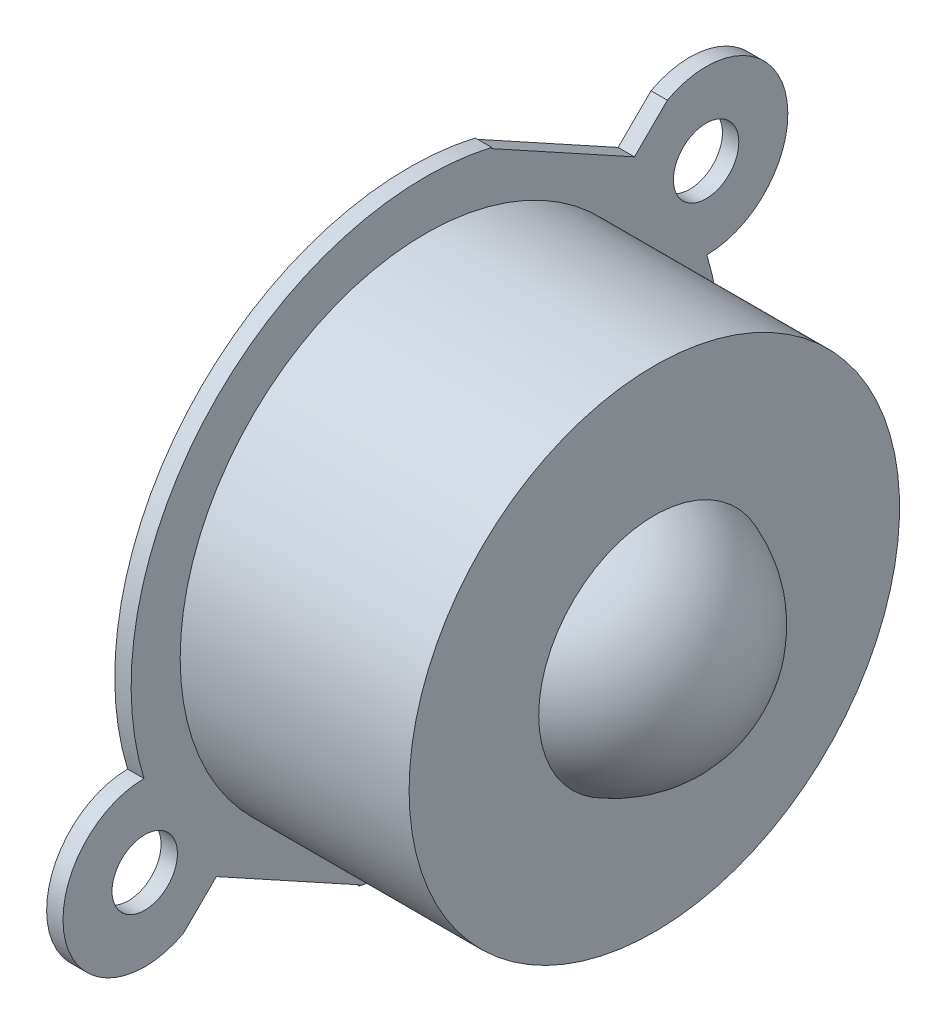
ISO-10303-21;
HEADER;
FILE_DESCRIPTION(('STEP AP214'),'2;1');
FILE_NAME('part.step','',(''),(''),'','','');
FILE_SCHEMA(('AUTOMOTIVE_DESIGN { 1 0 10303 214 1 1 1 1 }'));
ENDSEC;
DATA;
#1=APPLICATION_CONTEXT('core data for automotive mechanical design processes');
#2=APPLICATION_PROTOCOL_DEFINITION('international standard','automotive_design',2000,#1);
#3=PRODUCT_CONTEXT('',#1,'mechanical');
#4=PRODUCT('Part','Part','',(#3));
#5=PRODUCT_RELATED_PRODUCT_CATEGORY('part','',(#4));
#6=PRODUCT_DEFINITION_FORMATION('','',#4);
#7=PRODUCT_DEFINITION_CONTEXT('part definition',#1,'design');
#8=PRODUCT_DEFINITION('design','',#6,#7);
#9=PRODUCT_DEFINITION_SHAPE('','',#8);
#10=(LENGTH_UNIT() NAMED_UNIT(*) SI_UNIT(.MILLI.,.METRE.));
#11=(NAMED_UNIT(*) PLANE_ANGLE_UNIT() SI_UNIT($,.RADIAN.));
#12=(NAMED_UNIT(*) SI_UNIT($,.STERADIAN.) SOLID_ANGLE_UNIT());
#13=UNCERTAINTY_MEASURE_WITH_UNIT(LENGTH_MEASURE(1.E-05),#10,'distance_accuracy_value','');
#14=(GEOMETRIC_REPRESENTATION_CONTEXT(3) GLOBAL_UNCERTAINTY_ASSIGNED_CONTEXT((#13)) GLOBAL_UNIT_ASSIGNED_CONTEXT((#10,
#11,#12)) REPRESENTATION_CONTEXT('',''));
#15=CARTESIAN_POINT('',(0.,0.,0.));
#16=DIRECTION('',(0.,0.,1.));
#17=DIRECTION('',(1.,0.,0.));
#18=AXIS2_PLACEMENT_3D('',#15,#16,#17);
#19=CARTESIAN_POINT('',(0.,-15.,0.));
#20=DIRECTION('',(1.,0.,0.));
#21=DIRECTION('',(0.,0.,-1.));
#22=AXIS2_PLACEMENT_3D('',#19,#20,#21);
#23=PLANE('',#22);
#24=CARTESIAN_POINT('',(0.,-10.2598604714305,17.1678555185782));
#25=DIRECTION('',(1.,0.,0.));
#26=DIRECTION('',(0.,0.,1.));
#27=AXIS2_PLACEMENT_3D('',#24,#25,#26);
#28=CIRCLE('',#27,2.);
#29=CARTESIAN_POINT('',(0.,-10.2598604714305,19.1678555185782));
#30=VERTEX_POINT('',#29);
#31=EDGE_CURVE('E208',#30,#30,#28,.T.);
#32=ORIENTED_EDGE('',*,*,#31,.F.);
#33=EDGE_LOOP('',(#32));
#34=FACE_BOUND('',#33,.T.);
#35=CARTESIAN_POINT('',(0.,10.2598604714305,-17.1678555185782));
#36=DIRECTION('',(1.,0.,0.));
#37=DIRECTION('',(0.,0.,-1.));
#38=AXIS2_PLACEMENT_3D('',#35,#36,#37);
#39=CIRCLE('',#38,2.);
#40=CARTESIAN_POINT('',(0.,10.2598604714305,-19.1678555185782));
#41=VERTEX_POINT('',#40);
#42=EDGE_CURVE('E212',#41,#41,#39,.T.);
#43=ORIENTED_EDGE('',*,*,#42,.F.);
#44=EDGE_LOOP('',(#43));
#45=FACE_BOUND('',#44,.T.);
#46=CARTESIAN_POINT('',(0.,0.,0.));
#47=DIRECTION('',(-1.,0.,0.));
#48=DIRECTION('',(0.,0.,1.));
#49=AXIS2_PLACEMENT_3D('',#46,#47,#48);
#50=CIRCLE('',#49,15.);
#51=CARTESIAN_POINT('',(0.,0.,15.));
#52=VERTEX_POINT('',#51);
#53=EDGE_CURVE('E216',#52,#52,#50,.T.);
#54=ORIENTED_EDGE('',*,*,#53,.T.);
#55=EDGE_LOOP('',(#54));
#56=FACE_BOUND('',#55,.T.);
#57=CARTESIAN_POINT('',(0.,10.2598604714305,-17.1678555185782));
#58=DIRECTION('',(1.,0.,0.));
#59=DIRECTION('',(0.,0.,-1.));
#60=AXIS2_PLACEMENT_3D('',#57,#58,#59);
#61=CIRCLE('',#60,5.);
#62=CARTESIAN_POINT('',(0.,5.26007604358219,-17.2142847663135));
#63=VERTEX_POINT('',#62);
#64=CARTESIAN_POINT('',(0.,14.6632293174105,-14.7992392967616));
#65=VERTEX_POINT('',#64);
#66=EDGE_CURVE('E193',#63,#65,#61,.T.);
#67=ORIENTED_EDGE('',*,*,#66,.T.);
#68=DIRECTION('',(0.,-0.703835007235703,0.710363486244555));
#69=VECTOR('',#68,1.);
#70=CARTESIAN_POINT('',(0.,19.7073802025997,-19.8901776148475));
#71=LINE('',#70,#69);
#72=CARTESIAN_POINT('',(0.,12.6690301302427,-12.786542752402));
#73=VERTEX_POINT('',#72);
#74=EDGE_CURVE('E159',#65,#73,#71,.T.);
#75=ORIENTED_EDGE('',*,*,#74,.T.);
#76=DIRECTION('',(0.,0.481833931762426,0.876262553235252));
#77=VECTOR('',#76,1.);
#78=CARTESIAN_POINT('',(0.,12.6690301302427,-12.786542752402));
#79=LINE('',#78,#77);
#80=CARTESIAN_POINT('',(0.,17.4873694478669,-4.02391722004947));
#81=VERTEX_POINT('',#80);
#82=EDGE_CURVE('E190',#73,#81,#79,.T.);
#83=ORIENTED_EDGE('',*,*,#82,.T.);
#84=CARTESIAN_POINT('',(0.,10.2598604714305,-17.1678555185782));
#85=DIRECTION('',(1.,0.,0.));
#86=DIRECTION('',(0.,0.,-1.));
#87=AXIS2_PLACEMENT_3D('',#84,#85,#86);
#88=CIRCLE('',#87,15.);
#89=CARTESIAN_POINT('',(0.,17.5380198286192,-4.05189591314462));
#90=VERTEX_POINT('',#89);
#91=EDGE_CURVE('E187',#90,#81,#88,.T.);
#92=ORIENTED_EDGE('',*,*,#91,.F.);
#93=CARTESIAN_POINT('',(0.,0.,0.));
#94=DIRECTION('',(1.,0.,0.));
#95=DIRECTION('',(0.,0.,1.));
#96=AXIS2_PLACEMENT_3D('',#93,#94,#95);
#97=CIRCLE('',#96,18.);
#98=CARTESIAN_POINT('',(0.,-5.26007604358219,17.2142847663135));
#99=VERTEX_POINT('',#98);
#100=EDGE_CURVE('E175',#90,#99,#97,.T.);
#101=ORIENTED_EDGE('',*,*,#100,.T.);
#102=CARTESIAN_POINT('',(0.,-10.2598604714305,17.1678555185782));
#103=DIRECTION('',(1.,0.,0.));
#104=DIRECTION('',(0.,0.,-1.));
#105=AXIS2_PLACEMENT_3D('',#102,#103,#104);
#106=CIRCLE('',#105,5.);
#107=CARTESIAN_POINT('',(0.,-14.6632293174105,14.7992392967616));
#108=VERTEX_POINT('',#107);
#109=EDGE_CURVE('E173',#99,#108,#106,.T.);
#110=ORIENTED_EDGE('',*,*,#109,.T.);
#111=DIRECTION('',(0.,0.703835007235702,-0.710363486244555));
#112=VECTOR('',#111,1.);
#113=CARTESIAN_POINT('',(0.,-19.7073802025997,19.8901776148475));
#114=LINE('',#113,#112);
#115=CARTESIAN_POINT('',(0.,-12.6690301302427,12.786542752402));
#116=VERTEX_POINT('',#115);
#117=EDGE_CURVE('E172',#108,#116,#114,.T.);
#118=ORIENTED_EDGE('',*,*,#117,.T.);
#119=DIRECTION('',(0.,-0.481833931762426,-0.876262553235251));
#120=VECTOR('',#119,1.);
#121=CARTESIAN_POINT('',(0.,-12.6690301302427,12.786542752402));
#122=LINE('',#121,#120);
#123=CARTESIAN_POINT('',(0.,-17.4873694478669,4.02391722004947));
#124=VERTEX_POINT('',#123);
#125=EDGE_CURVE('E89',#116,#124,#122,.T.);
#126=ORIENTED_EDGE('',*,*,#125,.T.);
#127=CARTESIAN_POINT('',(0.,-10.2598604714305,17.1678555185782));
#128=DIRECTION('',(1.,0.,0.));
#129=DIRECTION('',(0.,0.,-1.));
#130=AXIS2_PLACEMENT_3D('',#127,#128,#129);
#131=CIRCLE('',#130,15.);
#132=CARTESIAN_POINT('',(0.,-17.5380198286192,4.05189591314462));
#133=VERTEX_POINT('',#132);
#134=EDGE_CURVE('E162',#133,#124,#131,.T.);
#135=ORIENTED_EDGE('',*,*,#134,.F.);
#136=CARTESIAN_POINT('',(0.,0.,0.));
#137=DIRECTION('',(1.,0.,0.));
#138=DIRECTION('',(0.,0.,1.));
#139=AXIS2_PLACEMENT_3D('',#136,#137,#138);
#140=CIRCLE('',#139,18.);
#141=EDGE_CURVE('E195',#133,#63,#140,.T.);
#142=ORIENTED_EDGE('',*,*,#141,.T.);
#143=EDGE_LOOP('',(#67,#75,#83,#92,#101,#110,#118,#126,#135,#142));
#144=FACE_BOUND('',#143,.T.);
#145=ADVANCED_FACE('F74',(#34,#45,#56,#144),#23,.T.);
#146=CARTESIAN_POINT('',(-0.999999999999998,-25.,0.));
#147=DIRECTION('',(-1.,0.,0.));
#148=DIRECTION('',(0.,0.,1.));
#149=AXIS2_PLACEMENT_3D('',#146,#147,#148);
#150=PLANE('',#149);
#151=CARTESIAN_POINT('',(-0.999999999999999,-10.2598604714305,17.1678555185782));
#152=DIRECTION('',(-1.,0.,0.));
#153=DIRECTION('',(0.,0.,1.));
#154=AXIS2_PLACEMENT_3D('',#151,#152,#153);
#155=CIRCLE('',#154,2.);
#156=CARTESIAN_POINT('',(-0.999999999999999,-10.2598604714305,19.1678555185782));
#157=VERTEX_POINT('',#156);
#158=EDGE_CURVE('E211',#157,#157,#155,.T.);
#159=ORIENTED_EDGE('',*,*,#158,.F.);
#160=EDGE_LOOP('',(#159));
#161=FACE_BOUND('',#160,.T.);
#162=CARTESIAN_POINT('',(-0.999999999999999,10.2598604714305,-17.1678555185782));
#163=DIRECTION('',(-1.,0.,0.));
#164=DIRECTION('',(0.,0.,1.));
#165=AXIS2_PLACEMENT_3D('',#162,#163,#164);
#166=CIRCLE('',#165,2.);
#167=CARTESIAN_POINT('',(-0.999999999999999,10.2598604714305,-15.1678555185782));
#168=VERTEX_POINT('',#167);
#169=EDGE_CURVE('E215',#168,#168,#166,.T.);
#170=ORIENTED_EDGE('',*,*,#169,.F.);
#171=EDGE_LOOP('',(#170));
#172=FACE_BOUND('',#171,.T.);
#173=CARTESIAN_POINT('',(-0.999999999999999,10.2598604714305,-17.1678555185782));
#174=DIRECTION('',(-1.,0.,0.));
#175=DIRECTION('',(0.,0.,1.));
#176=AXIS2_PLACEMENT_3D('',#173,#174,#175);
#177=CIRCLE('',#176,15.);
#178=CARTESIAN_POINT('',(-0.999999999999999,17.4873694478669,-4.02391722004947));
#179=VERTEX_POINT('',#178);
#180=CARTESIAN_POINT('',(-0.999999999999999,17.5380198286192,-4.05189591314462));
#181=VERTEX_POINT('',#180);
#182=EDGE_CURVE('E246',#179,#181,#177,.T.);
#183=ORIENTED_EDGE('',*,*,#182,.F.);
#184=DIRECTION('',(0.,-0.481833931762426,-0.876262553235252));
#185=VECTOR('',#184,1.);
#186=CARTESIAN_POINT('',(-0.999999999999998,9.32228473729008,-18.8729295129403));
#187=LINE('',#186,#185);
#188=CARTESIAN_POINT('',(-0.999999999999999,12.6690301302427,-12.786542752402));
#189=VERTEX_POINT('',#188);
#190=EDGE_CURVE('E12',#179,#189,#187,.T.);
#191=ORIENTED_EDGE('',*,*,#190,.T.);
#192=DIRECTION('',(0.,0.703835007235703,-0.710363486244555));
#193=VECTOR('',#192,1.);
#194=CARTESIAN_POINT('',(-0.999999999999998,-12.3845929352621,12.4994672370229));
#195=LINE('',#194,#193);
#196=CARTESIAN_POINT('',(-0.999999999999999,14.6632293174105,-14.7992392967616));
#197=VERTEX_POINT('',#196);
#198=EDGE_CURVE('E82',#189,#197,#195,.T.);
#199=ORIENTED_EDGE('',*,*,#198,.T.);
#200=CARTESIAN_POINT('',(-0.999999999999999,10.2598604714305,-17.1678555185782));
#201=DIRECTION('',(-1.,0.,0.));
#202=DIRECTION('',(0.,0.,1.));
#203=AXIS2_PLACEMENT_3D('',#200,#201,#202);
#204=CIRCLE('',#203,5.);
#205=CARTESIAN_POINT('',(-0.999999999999999,5.26007604358219,-17.2142847663135));
#206=VERTEX_POINT('',#205);
#207=EDGE_CURVE('E240',#197,#206,#204,.T.);
#208=ORIENTED_EDGE('',*,*,#207,.T.);
#209=CARTESIAN_POINT('',(-0.999999999999999,0.,0.));
#210=DIRECTION('',(-1.,0.,0.));
#211=DIRECTION('',(0.,0.,1.));
#212=AXIS2_PLACEMENT_3D('',#209,#210,#211);
#213=CIRCLE('',#212,18.);
#214=CARTESIAN_POINT('',(-0.999999999999999,-17.5380198286192,4.05189591314462));
#215=VERTEX_POINT('',#214);
#216=EDGE_CURVE('E235',#206,#215,#213,.T.);
#217=ORIENTED_EDGE('',*,*,#216,.T.);
#218=CARTESIAN_POINT('',(-0.999999999999999,-10.2598604714305,17.1678555185782));
#219=DIRECTION('',(-1.,0.,0.));
#220=DIRECTION('',(0.,0.,1.));
#221=AXIS2_PLACEMENT_3D('',#218,#219,#220);
#222=CIRCLE('',#221,15.);
#223=CARTESIAN_POINT('',(-0.999999999999999,-17.4873694478669,4.02391722004947));
#224=VERTEX_POINT('',#223);
#225=EDGE_CURVE('E233',#224,#215,#222,.T.);
#226=ORIENTED_EDGE('',*,*,#225,.F.);
#227=DIRECTION('',(0.,0.481833931762426,0.876262553235252));
#228=VECTOR('',#227,1.);
#229=CARTESIAN_POINT('',(-0.999999999999998,-20.930481627172,-2.23772205113588));
#230=LINE('',#229,#228);
#231=CARTESIAN_POINT('',(-0.999999999999999,-12.6690301302427,12.786542752402));
#232=VERTEX_POINT('',#231);
#233=EDGE_CURVE('E155',#224,#232,#230,.T.);
#234=ORIENTED_EDGE('',*,*,#233,.T.);
#235=DIRECTION('',(0.,-0.703835007235702,0.710363486244555));
#236=VECTOR('',#235,1.);
#237=CARTESIAN_POINT('',(-0.999999999999998,-12.384592935262,12.4994672370229));
#238=LINE('',#237,#236);
#239=CARTESIAN_POINT('',(-0.999999999999998,-14.6632293174105,14.7992392967616));
#240=VERTEX_POINT('',#239);
#241=EDGE_CURVE('E225',#232,#240,#238,.T.);
#242=ORIENTED_EDGE('',*,*,#241,.T.);
#243=CARTESIAN_POINT('',(-0.999999999999999,-10.2598604714305,17.1678555185782));
#244=DIRECTION('',(-1.,0.,0.));
#245=DIRECTION('',(0.,0.,1.));
#246=AXIS2_PLACEMENT_3D('',#243,#244,#245);
#247=CIRCLE('',#246,5.);
#248=CARTESIAN_POINT('',(-0.999999999999999,-5.26007604358219,17.2142847663135));
#249=VERTEX_POINT('',#248);
#250=EDGE_CURVE('E238',#240,#249,#247,.T.);
#251=ORIENTED_EDGE('',*,*,#250,.T.);
#252=CARTESIAN_POINT('',(-0.999999999999999,0.,0.));
#253=DIRECTION('',(-1.,0.,0.));
#254=DIRECTION('',(0.,0.,1.));
#255=AXIS2_PLACEMENT_3D('',#252,#253,#254);
#256=CIRCLE('',#255,18.);
#257=EDGE_CURVE('E243',#249,#181,#256,.T.);
#258=ORIENTED_EDGE('',*,*,#257,.T.);
#259=EDGE_LOOP('',(#183,#191,#199,#208,#217,#226,#234,#242,#251,#258));
#260=FACE_BOUND('',#259,.T.);
#261=ADVANCED_FACE('F250',(#161,#172,#260),#150,.T.);
#262=CARTESIAN_POINT('',(11.5,0.,0.));
#263=DIRECTION('',(-1.,0.,0.));
#264=DIRECTION('',(0.,-1.,0.));
#265=AXIS2_PLACEMENT_3D('',#262,#263,#264);
#266=SPHERICAL_SURFACE('',#265,7.5);
#267=CARTESIAN_POINT('',(14.,0.,0.));
#268=DIRECTION('',(-1.,0.,0.));
#269=DIRECTION('',(0.,0.,1.));
#270=AXIS2_PLACEMENT_3D('',#267,#268,#269);
#271=CIRCLE('',#270,7.07106781186547);
#272=CARTESIAN_POINT('',(14.,0.,7.07106781186547));
#273=VERTEX_POINT('',#272);
#274=EDGE_CURVE('E222',#273,#273,#271,.T.);
#275=ORIENTED_EDGE('',*,*,#274,.F.);
#276=EDGE_LOOP('',(#275));
#277=FACE_BOUND('',#276,.T.);
#278=ADVANCED_FACE('F76',(#277),#266,.T.);
#279=CARTESIAN_POINT('',(14.,-7.07106781186547,0.));
#280=DIRECTION('',(1.,0.,0.));
#281=DIRECTION('',(0.,0.,-1.));
#282=AXIS2_PLACEMENT_3D('',#279,#280,#281);
#283=PLANE('',#282);
#284=ORIENTED_EDGE('',*,*,#274,.T.);
#285=EDGE_LOOP('',(#284));
#286=FACE_BOUND('',#285,.T.);
#287=CARTESIAN_POINT('',(14.,0.,0.));
#288=DIRECTION('',(-1.,0.,0.));
#289=DIRECTION('',(0.,0.,1.));
#290=AXIS2_PLACEMENT_3D('',#287,#288,#289);
#291=CIRCLE('',#290,15.);
#292=CARTESIAN_POINT('',(14.,0.,15.));
#293=VERTEX_POINT('',#292);
#294=EDGE_CURVE('E219',#293,#293,#291,.T.);
#295=ORIENTED_EDGE('',*,*,#294,.F.);
#296=EDGE_LOOP('',(#295));
#297=FACE_BOUND('',#296,.T.);
#298=ADVANCED_FACE('F293',(#286,#297),#283,.T.);
#299=CARTESIAN_POINT('',(-63.1017389839961,0.,0.));
#300=DIRECTION('',(-1.,0.,0.));
#301=DIRECTION('',(0.,0.,1.));
#302=AXIS2_PLACEMENT_3D('',#299,#300,#301);
#303=CYLINDRICAL_SURFACE('',#302,15.);
#304=ORIENTED_EDGE('',*,*,#294,.T.);
#305=EDGE_LOOP('',(#304));
#306=FACE_BOUND('',#305,.T.);
#307=ORIENTED_EDGE('',*,*,#53,.F.);
#308=EDGE_LOOP('',(#307));
#309=FACE_BOUND('',#308,.T.);
#310=ADVANCED_FACE('F290',(#306,#309),#303,.T.);
#311=CARTESIAN_POINT('',(-10.,10.2598604714305,-17.1678555185782));
#312=DIRECTION('',(1.,0.,0.));
#313=DIRECTION('',(0.,0.,-1.));
#314=AXIS2_PLACEMENT_3D('',#311,#312,#313);
#315=CYLINDRICAL_SURFACE('',#314,2.);
#316=ORIENTED_EDGE('',*,*,#169,.T.);
#317=EDGE_LOOP('',(#316));
#318=FACE_BOUND('',#317,.T.);
#319=ORIENTED_EDGE('',*,*,#42,.T.);
#320=EDGE_LOOP('',(#319));
#321=FACE_BOUND('',#320,.T.);
#322=ADVANCED_FACE('F292',(#318,#321),#315,.F.);
#323=CARTESIAN_POINT('',(-10.,-10.2598604714305,17.1678555185782));
#324=DIRECTION('',(1.,0.,0.));
#325=DIRECTION('',(0.,0.,-1.));
#326=AXIS2_PLACEMENT_3D('',#323,#324,#325);
#327=CYLINDRICAL_SURFACE('',#326,2.);
#328=ORIENTED_EDGE('',*,*,#158,.T.);
#329=EDGE_LOOP('',(#328));
#330=FACE_BOUND('',#329,.T.);
#331=ORIENTED_EDGE('',*,*,#31,.T.);
#332=EDGE_LOOP('',(#331));
#333=FACE_BOUND('',#332,.T.);
#334=ADVANCED_FACE('F327',(#330,#333),#327,.F.);
#335=CARTESIAN_POINT('',(-10.,-10.2598604714305,17.1678555185782));
#336=DIRECTION('',(1.,0.,0.));
#337=DIRECTION('',(0.,0.,-1.));
#338=AXIS2_PLACEMENT_3D('',#335,#336,#337);
#339=CYLINDRICAL_SURFACE('',#338,5.);
#340=DIRECTION('',(1.,0.,0.));
#341=VECTOR('',#340,1.);
#342=CARTESIAN_POINT('',(-10.,-5.26007604358219,17.2142847663135));
#343=LINE('',#342,#341);
#344=EDGE_CURVE('E184',#249,#99,#343,.T.);
#345=ORIENTED_EDGE('',*,*,#344,.F.);
#346=ORIENTED_EDGE('',*,*,#250,.F.);
#347=DIRECTION('',(1.,0.,0.));
#348=VECTOR('',#347,1.);
#349=CARTESIAN_POINT('',(-10.,-14.6632293174105,14.7992392967616));
#350=LINE('',#349,#348);
#351=EDGE_CURVE('E97',#240,#108,#350,.T.);
#352=ORIENTED_EDGE('',*,*,#351,.T.);
#353=ORIENTED_EDGE('',*,*,#109,.F.);
#354=EDGE_LOOP('',(#345,#346,#352,#353));
#355=FACE_BOUND('',#354,.T.);
#356=ADVANCED_FACE('F322',(#355),#339,.T.);
#357=CARTESIAN_POINT('',(-10.,10.2598604714305,-17.1678555185782));
#358=DIRECTION('',(1.,0.,0.));
#359=DIRECTION('',(0.,0.,-1.));
#360=AXIS2_PLACEMENT_3D('',#357,#358,#359);
#361=CYLINDRICAL_SURFACE('',#360,5.);
#362=ORIENTED_EDGE('',*,*,#207,.F.);
#363=DIRECTION('',(1.,0.,0.));
#364=VECTOR('',#363,1.);
#365=CARTESIAN_POINT('',(-10.,14.6632293174105,-14.7992392967616));
#366=LINE('',#365,#364);
#367=EDGE_CURVE('E204',#65,#197,#366,.F.);
#368=ORIENTED_EDGE('',*,*,#367,.F.);
#369=ORIENTED_EDGE('',*,*,#66,.F.);
#370=DIRECTION('',(1.,0.,0.));
#371=VECTOR('',#370,1.);
#372=CARTESIAN_POINT('',(-10.,5.26007604358219,-17.2142847663135));
#373=LINE('',#372,#371);
#374=EDGE_CURVE('E169',#206,#63,#373,.T.);
#375=ORIENTED_EDGE('',*,*,#374,.F.);
#376=EDGE_LOOP('',(#362,#368,#369,#375));
#377=FACE_BOUND('',#376,.T.);
#378=ADVANCED_FACE('F264',(#377),#361,.T.);
#379=CARTESIAN_POINT('',(-10.,0.,0.));
#380=DIRECTION('',(1.,0.,0.));
#381=DIRECTION('',(0.,0.,-1.));
#382=AXIS2_PLACEMENT_3D('',#379,#380,#381);
#383=CYLINDRICAL_SURFACE('',#382,18.);
#384=ORIENTED_EDGE('',*,*,#344,.T.);
#385=ORIENTED_EDGE('',*,*,#100,.F.);
#386=DIRECTION('',(1.,0.,0.));
#387=VECTOR('',#386,1.);
#388=CARTESIAN_POINT('',(-5.,17.5380198286192,-4.05189591314462));
#389=LINE('',#388,#387);
#390=EDGE_CURVE('E202',#181,#90,#389,.T.);
#391=ORIENTED_EDGE('',*,*,#390,.F.);
#392=ORIENTED_EDGE('',*,*,#257,.F.);
#393=EDGE_LOOP('',(#384,#385,#391,#392));
#394=FACE_BOUND('',#393,.T.);
#395=ADVANCED_FACE('F338',(#394),#383,.T.);
#396=CARTESIAN_POINT('',(-10.,0.,0.));
#397=DIRECTION('',(1.,0.,0.));
#398=DIRECTION('',(0.,0.,-1.));
#399=AXIS2_PLACEMENT_3D('',#396,#397,#398);
#400=CYLINDRICAL_SURFACE('',#399,18.);
#401=ORIENTED_EDGE('',*,*,#374,.T.);
#402=ORIENTED_EDGE('',*,*,#141,.F.);
#403=DIRECTION('',(1.,0.,0.));
#404=VECTOR('',#403,1.);
#405=CARTESIAN_POINT('',(-5.,-17.5380198286192,4.05189591314462));
#406=LINE('',#405,#404);
#407=EDGE_CURVE('E165',#133,#215,#406,.F.);
#408=ORIENTED_EDGE('',*,*,#407,.T.);
#409=ORIENTED_EDGE('',*,*,#216,.F.);
#410=EDGE_LOOP('',(#401,#402,#408,#409));
#411=FACE_BOUND('',#410,.T.);
#412=ADVANCED_FACE('F266',(#411),#400,.T.);
#413=CARTESIAN_POINT('',(-10.,19.7073802025997,-19.8901776148475));
#414=DIRECTION('',(0.,0.710363486244555,0.703835007235703));
#415=DIRECTION('',(0.,-0.703835007235703,0.710363486244555));
#416=AXIS2_PLACEMENT_3D('',#413,#414,#415);
#417=PLANE('',#416);
#418=DIRECTION('',(1.,0.,0.));
#419=VECTOR('',#418,1.);
#420=CARTESIAN_POINT('',(-10.,12.6690301302427,-12.786542752402));
#421=LINE('',#420,#419);
#422=EDGE_CURVE('E182',#189,#73,#421,.T.);
#423=ORIENTED_EDGE('',*,*,#422,.T.);
#424=ORIENTED_EDGE('',*,*,#74,.F.);
#425=ORIENTED_EDGE('',*,*,#367,.T.);
#426=ORIENTED_EDGE('',*,*,#198,.F.);
#427=EDGE_LOOP('',(#423,#424,#425,#426));
#428=FACE_BOUND('',#427,.T.);
#429=ADVANCED_FACE('F253',(#428),#417,.T.);
#430=CARTESIAN_POINT('',(-10.,-10.2598604714305,17.1678555185782));
#431=DIRECTION('',(1.,0.,0.));
#432=DIRECTION('',(0.,0.,-1.));
#433=AXIS2_PLACEMENT_3D('',#430,#431,#432);
#434=CYLINDRICAL_SURFACE('',#433,15.);
#435=ORIENTED_EDGE('',*,*,#225,.T.);
#436=ORIENTED_EDGE('',*,*,#407,.F.);
#437=ORIENTED_EDGE('',*,*,#134,.T.);
#438=DIRECTION('',(1.,0.,0.));
#439=VECTOR('',#438,1.);
#440=CARTESIAN_POINT('',(-10.,-17.4873694478669,4.02391722004947));
#441=LINE('',#440,#439);
#442=EDGE_CURVE('E151',#224,#124,#441,.T.);
#443=ORIENTED_EDGE('',*,*,#442,.F.);
#444=EDGE_LOOP('',(#435,#436,#437,#443));
#445=FACE_BOUND('',#444,.T.);
#446=ADVANCED_FACE('F163',(#445),#434,.F.);
#447=CARTESIAN_POINT('',(-10.,-12.6690301302427,12.786542752402));
#448=DIRECTION('',(0.,-0.876262553235252,0.481833931762426));
#449=DIRECTION('',(0.,-0.481833931762426,-0.876262553235252));
#450=AXIS2_PLACEMENT_3D('',#447,#448,#449);
#451=PLANE('',#450);
#452=ORIENTED_EDGE('',*,*,#442,.T.);
#453=ORIENTED_EDGE('',*,*,#125,.F.);
#454=DIRECTION('',(1.,0.,0.));
#455=VECTOR('',#454,1.);
#456=CARTESIAN_POINT('',(-10.,-12.6690301302427,12.786542752402));
#457=LINE('',#456,#455);
#458=EDGE_CURVE('E158',#232,#116,#457,.T.);
#459=ORIENTED_EDGE('',*,*,#458,.F.);
#460=ORIENTED_EDGE('',*,*,#233,.F.);
#461=EDGE_LOOP('',(#452,#453,#459,#460));
#462=FACE_BOUND('',#461,.T.);
#463=ADVANCED_FACE('F153',(#462),#451,.T.);
#464=CARTESIAN_POINT('',(-10.,10.2598604714305,-17.1678555185782));
#465=DIRECTION('',(1.,0.,0.));
#466=DIRECTION('',(0.,0.,-1.));
#467=AXIS2_PLACEMENT_3D('',#464,#465,#466);
#468=CYLINDRICAL_SURFACE('',#467,15.);
#469=ORIENTED_EDGE('',*,*,#182,.T.);
#470=ORIENTED_EDGE('',*,*,#390,.T.);
#471=ORIENTED_EDGE('',*,*,#91,.T.);
#472=DIRECTION('',(1.,0.,0.));
#473=VECTOR('',#472,1.);
#474=CARTESIAN_POINT('',(-10.,17.4873694478669,-4.02391722004947));
#475=LINE('',#474,#473);
#476=EDGE_CURVE('E198',#179,#81,#475,.T.);
#477=ORIENTED_EDGE('',*,*,#476,.F.);
#478=EDGE_LOOP('',(#469,#470,#471,#477));
#479=FACE_BOUND('',#478,.T.);
#480=ADVANCED_FACE('F274',(#479),#468,.F.);
#481=CARTESIAN_POINT('',(-10.,12.6690301302427,-12.786542752402));
#482=DIRECTION('',(0.,0.876262553235252,-0.481833931762426));
#483=DIRECTION('',(0.,0.481833931762426,0.876262553235252));
#484=AXIS2_PLACEMENT_3D('',#481,#482,#483);
#485=PLANE('',#484);
#486=ORIENTED_EDGE('',*,*,#476,.T.);
#487=ORIENTED_EDGE('',*,*,#82,.F.);
#488=ORIENTED_EDGE('',*,*,#422,.F.);
#489=ORIENTED_EDGE('',*,*,#190,.F.);
#490=EDGE_LOOP('',(#486,#487,#488,#489));
#491=FACE_BOUND('',#490,.T.);
#492=ADVANCED_FACE('F258',(#491),#485,.T.);
#493=CARTESIAN_POINT('',(-10.,-19.7073802025997,19.8901776148475));
#494=DIRECTION('',(0.,-0.710363486244555,-0.703835007235702));
#495=DIRECTION('',(0.,0.703835007235702,-0.710363486244555));
#496=AXIS2_PLACEMENT_3D('',#493,#494,#495);
#497=PLANE('',#496);
#498=ORIENTED_EDGE('',*,*,#458,.T.);
#499=ORIENTED_EDGE('',*,*,#117,.F.);
#500=ORIENTED_EDGE('',*,*,#351,.F.);
#501=ORIENTED_EDGE('',*,*,#241,.F.);
#502=EDGE_LOOP('',(#498,#499,#500,#501));
#503=FACE_BOUND('',#502,.T.);
#504=ADVANCED_FACE('F268',(#503),#497,.T.);
#505=CLOSED_SHELL('',(#145,#261,#278,#298,#310,#322,#334,#356,#378,#395,#412,#429,#446,#463,
#480,#492,#504));
#506=MANIFOLD_SOLID_BREP('B2',#505);
#507=ADVANCED_BREP_SHAPE_REPRESENTATION('',(#18,#506),#14);
#508=SHAPE_DEFINITION_REPRESENTATION(#9,#507);
ENDSEC;
END-ISO-10303-21;
